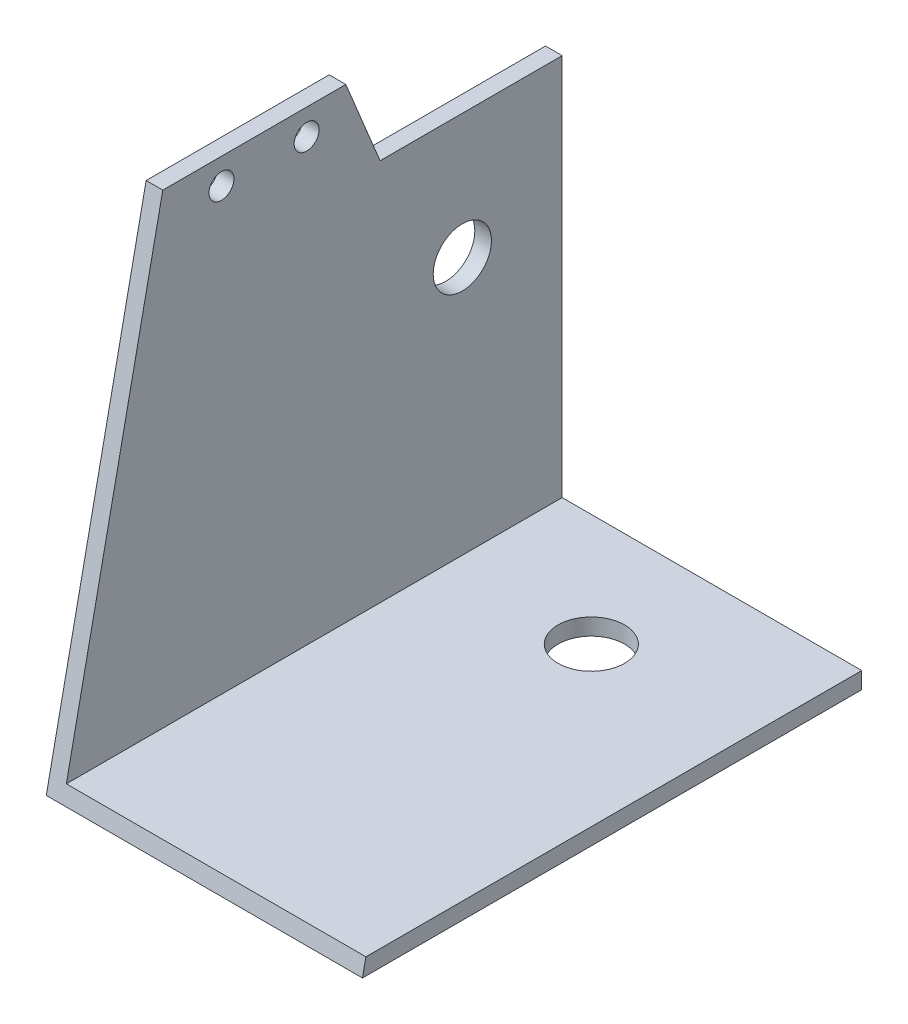
ISO-10303-21;
HEADER;
FILE_DESCRIPTION(('STEP AP214'),'2;1');
FILE_NAME('part.step','',(''),(''),'','','');
FILE_SCHEMA(('AUTOMOTIVE_DESIGN { 1 0 10303 214 1 1 1 1 }'));
ENDSEC;
DATA;
#1=APPLICATION_CONTEXT('core data for automotive mechanical design processes');
#2=APPLICATION_PROTOCOL_DEFINITION('international standard','automotive_design',2000,#1);
#3=PRODUCT_CONTEXT('',#1,'mechanical');
#4=PRODUCT('Part','Part','',(#3));
#5=PRODUCT_RELATED_PRODUCT_CATEGORY('part','',(#4));
#6=PRODUCT_DEFINITION_FORMATION('','',#4);
#7=PRODUCT_DEFINITION_CONTEXT('part definition',#1,'design');
#8=PRODUCT_DEFINITION('design','',#6,#7);
#9=PRODUCT_DEFINITION_SHAPE('','',#8);
#10=(LENGTH_UNIT() NAMED_UNIT(*) SI_UNIT(.MILLI.,.METRE.));
#11=(NAMED_UNIT(*) PLANE_ANGLE_UNIT() SI_UNIT($,.RADIAN.));
#12=(NAMED_UNIT(*) SI_UNIT($,.STERADIAN.) SOLID_ANGLE_UNIT());
#13=UNCERTAINTY_MEASURE_WITH_UNIT(LENGTH_MEASURE(1.E-05),#10,'distance_accuracy_value','');
#14=(GEOMETRIC_REPRESENTATION_CONTEXT(3) GLOBAL_UNCERTAINTY_ASSIGNED_CONTEXT((#13)) GLOBAL_UNIT_ASSIGNED_CONTEXT((#10,
#11,#12)) REPRESENTATION_CONTEXT('',''));
#15=CARTESIAN_POINT('',(0.,0.,0.));
#16=DIRECTION('',(0.,0.,1.));
#17=DIRECTION('',(1.,0.,0.));
#18=AXIS2_PLACEMENT_3D('',#15,#16,#17);
#19=CARTESIAN_POINT('',(2.,58.,60.));
#20=DIRECTION('',(0.,-1.,0.));
#21=DIRECTION('',(0.,0.,-1.));
#22=AXIS2_PLACEMENT_3D('',#19,#20,#21);
#23=PLANE('',#22);
#24=DIRECTION('',(0.,0.,-1.));
#25=VECTOR('',#24,1.);
#26=CARTESIAN_POINT('',(0.,58.,60.));
#27=LINE('',#26,#25);
#28=CARTESIAN_POINT('',(0.,58.,48.));
#29=VERTEX_POINT('',#28);
#30=CARTESIAN_POINT('',(0.,58.,26.));
#31=VERTEX_POINT('',#30);
#32=EDGE_CURVE('E133',#29,#31,#27,.T.);
#33=ORIENTED_EDGE('',*,*,#32,.F.);
#34=DIRECTION('',(-1.,0.,0.));
#35=VECTOR('',#34,1.);
#36=CARTESIAN_POINT('',(38.,58.,48.));
#37=LINE('',#36,#35);
#38=CARTESIAN_POINT('',(2.,58.,48.));
#39=VERTEX_POINT('',#38);
#40=EDGE_CURVE('E168',#39,#29,#37,.T.);
#41=ORIENTED_EDGE('',*,*,#40,.F.);
#42=DIRECTION('',(0.,0.,-1.));
#43=VECTOR('',#42,1.);
#44=CARTESIAN_POINT('',(2.,58.,60.));
#45=LINE('',#44,#43);
#46=CARTESIAN_POINT('',(2.,58.,26.));
#47=VERTEX_POINT('',#46);
#48=EDGE_CURVE('E121',#39,#47,#45,.T.);
#49=ORIENTED_EDGE('',*,*,#48,.T.);
#50=DIRECTION('',(-1.,0.,0.));
#51=VECTOR('',#50,1.);
#52=CARTESIAN_POINT('',(38.,58.,26.));
#53=LINE('',#52,#51);
#54=EDGE_CURVE('E179',#47,#31,#53,.T.);
#55=ORIENTED_EDGE('',*,*,#54,.T.);
#56=EDGE_LOOP('',(#33,#41,#49,#55));
#57=FACE_BOUND('',#56,.T.);
#58=ADVANCED_FACE('F39',(#57),#23,.F.);
#59=CARTESIAN_POINT('',(0.,58.,60.));
#60=DIRECTION('',(1.,0.,0.));
#61=DIRECTION('',(0.,1.,0.));
#62=AXIS2_PLACEMENT_3D('',#59,#60,#61);
#63=PLANE('',#62);
#64=CARTESIAN_POINT('',(0.,33.,12.));
#65=DIRECTION('',(-1.,0.,0.));
#66=DIRECTION('',(0.,-1.,0.));
#67=AXIS2_PLACEMENT_3D('',#64,#65,#66);
#68=CIRCLE('',#67,3.5);
#69=CARTESIAN_POINT('',(0.,29.5,12.));
#70=VERTEX_POINT('',#69);
#71=EDGE_CURVE('E190',#70,#70,#68,.T.);
#72=ORIENTED_EDGE('',*,*,#71,.F.);
#73=EDGE_LOOP('',(#72));
#74=FACE_BOUND('',#73,.T.);
#75=CARTESIAN_POINT('',(0.,54.9126669429679,40.9484063406696));
#76=DIRECTION('',(-1.,0.,0.));
#77=DIRECTION('',(0.,-1.,0.));
#78=AXIS2_PLACEMENT_3D('',#75,#76,#77);
#79=CIRCLE('',#78,1.5);
#80=CARTESIAN_POINT('',(0.,53.4126669429679,40.9484063406696));
#81=VERTEX_POINT('',#80);
#82=EDGE_CURVE('E174',#81,#81,#79,.T.);
#83=ORIENTED_EDGE('',*,*,#82,.F.);
#84=EDGE_LOOP('',(#83));
#85=FACE_BOUND('',#84,.T.);
#86=CARTESIAN_POINT('',(0.,54.9126669429679,30.7108512919076));
#87=DIRECTION('',(-1.,0.,0.));
#88=DIRECTION('',(0.,-1.,0.));
#89=AXIS2_PLACEMENT_3D('',#86,#87,#88);
#90=CIRCLE('',#89,1.5);
#91=CARTESIAN_POINT('',(0.,53.4126669429679,30.7108512919076));
#92=VERTEX_POINT('',#91);
#93=EDGE_CURVE('E169',#92,#92,#90,.T.);
#94=ORIENTED_EDGE('',*,*,#93,.F.);
#95=EDGE_LOOP('',(#94));
#96=FACE_BOUND('',#95,.T.);
#97=DIRECTION('',(0.,0.,-1.));
#98=VECTOR('',#97,1.);
#99=CARTESIAN_POINT('',(0.,0.,60.));
#100=LINE('',#99,#98);
#101=CARTESIAN_POINT('',(0.,0.,60.));
#102=VERTEX_POINT('',#101);
#103=CARTESIAN_POINT('',(0.,0.,0.));
#104=VERTEX_POINT('',#103);
#105=EDGE_CURVE('E129',#102,#104,#100,.T.);
#106=ORIENTED_EDGE('',*,*,#105,.F.);
#107=DIRECTION('',(0.,-0.979260419507103,0.202605604035952));
#108=VECTOR('',#107,1.);
#109=CARTESIAN_POINT('',(0.,58.,48.));
#110=LINE('',#109,#108);
#111=EDGE_CURVE('E65',#29,#102,#110,.T.);
#112=ORIENTED_EDGE('',*,*,#111,.F.);
#113=ORIENTED_EDGE('',*,*,#32,.T.);
#114=DIRECTION('',(0.,0.924751216689497,0.380572183995749));
#115=VECTOR('',#114,1.);
#116=CARTESIAN_POINT('',(0.,58.,26.));
#117=LINE('',#116,#115);
#118=CARTESIAN_POINT('',(0.,48.,21.8845992616462));
#119=VERTEX_POINT('',#118);
#120=EDGE_CURVE('E180',#119,#31,#117,.T.);
#121=ORIENTED_EDGE('',*,*,#120,.F.);
#122=DIRECTION('',(0.,0.,1.));
#123=VECTOR('',#122,1.);
#124=CARTESIAN_POINT('',(0.,48.,21.8845992616462));
#125=LINE('',#124,#123);
#126=CARTESIAN_POINT('',(0.,48.,0.));
#127=VERTEX_POINT('',#126);
#128=EDGE_CURVE('E173',#127,#119,#125,.T.);
#129=ORIENTED_EDGE('',*,*,#128,.F.);
#130=DIRECTION('',(0.,-1.,0.));
#131=VECTOR('',#130,1.);
#132=CARTESIAN_POINT('',(0.,58.,0.));
#133=LINE('',#132,#131);
#134=EDGE_CURVE('E149',#127,#104,#133,.T.);
#135=ORIENTED_EDGE('',*,*,#134,.T.);
#136=EDGE_LOOP('',(#106,#112,#113,#121,#129,#135));
#137=FACE_BOUND('',#136,.T.);
#138=ADVANCED_FACE('F226',(#74,#85,#96,#137),#63,.F.);
#139=CARTESIAN_POINT('',(0.,0.,60.));
#140=DIRECTION('',(0.,1.,0.));
#141=DIRECTION('',(0.,0.,1.));
#142=AXIS2_PLACEMENT_3D('',#139,#140,#141);
#143=PLANE('',#142);
#144=CARTESIAN_POINT('',(19.,0.,13.5));
#145=DIRECTION('',(0.,-1.,0.));
#146=DIRECTION('',(0.,0.,-1.));
#147=AXIS2_PLACEMENT_3D('',#144,#145,#146);
#148=CIRCLE('',#147,4.);
#149=CARTESIAN_POINT('',(19.,0.,9.5));
#150=VERTEX_POINT('',#149);
#151=EDGE_CURVE('E204',#150,#150,#148,.T.);
#152=ORIENTED_EDGE('',*,*,#151,.F.);
#153=EDGE_LOOP('',(#152));
#154=FACE_BOUND('',#153,.T.);
#155=DIRECTION('',(1.,0.,0.));
#156=VECTOR('',#155,1.);
#157=CARTESIAN_POINT('',(0.,0.,0.));
#158=LINE('',#157,#156);
#159=CARTESIAN_POINT('',(38.,0.,0.));
#160=VERTEX_POINT('',#159);
#161=EDGE_CURVE('E108',#104,#160,#158,.T.);
#162=ORIENTED_EDGE('',*,*,#161,.T.);
#163=DIRECTION('',(0.,0.,-1.));
#164=VECTOR('',#163,1.);
#165=CARTESIAN_POINT('',(38.,0.,60.));
#166=LINE('',#165,#164);
#167=CARTESIAN_POINT('',(38.,0.,60.));
#168=VERTEX_POINT('',#167);
#169=EDGE_CURVE('E97',#168,#160,#166,.T.);
#170=ORIENTED_EDGE('',*,*,#169,.F.);
#171=DIRECTION('',(1.,0.,0.));
#172=VECTOR('',#171,1.);
#173=CARTESIAN_POINT('',(0.,0.,60.));
#174=LINE('',#173,#172);
#175=EDGE_CURVE('E117',#102,#168,#174,.T.);
#176=ORIENTED_EDGE('',*,*,#175,.F.);
#177=ORIENTED_EDGE('',*,*,#105,.T.);
#178=EDGE_LOOP('',(#162,#170,#176,#177));
#179=FACE_BOUND('',#178,.T.);
#180=ADVANCED_FACE('F231',(#154,#179),#143,.F.);
#181=CARTESIAN_POINT('',(38.,0.,60.));
#182=DIRECTION('',(-1.,0.,0.));
#183=DIRECTION('',(0.,0.,1.));
#184=AXIS2_PLACEMENT_3D('',#181,#182,#183);
#185=PLANE('',#184);
#186=DIRECTION('',(0.,0.,-1.));
#187=VECTOR('',#186,1.);
#188=CARTESIAN_POINT('',(38.,2.,60.));
#189=LINE('',#188,#187);
#190=CARTESIAN_POINT('',(38.,2.,59.5862068965517));
#191=VERTEX_POINT('',#190);
#192=CARTESIAN_POINT('',(38.,2.,0.));
#193=VERTEX_POINT('',#192);
#194=EDGE_CURVE('E84',#191,#193,#189,.T.);
#195=ORIENTED_EDGE('',*,*,#194,.F.);
#196=DIRECTION('',(0.,-0.979260419507103,0.202605604035952));
#197=VECTOR('',#196,1.);
#198=CARTESIAN_POINT('',(38.,58.,48.));
#199=LINE('',#198,#197);
#200=EDGE_CURVE('E199',#191,#168,#199,.T.);
#201=ORIENTED_EDGE('',*,*,#200,.T.);
#202=ORIENTED_EDGE('',*,*,#169,.T.);
#203=DIRECTION('',(0.,1.,0.));
#204=VECTOR('',#203,1.);
#205=CARTESIAN_POINT('',(38.,0.,0.));
#206=LINE('',#205,#204);
#207=EDGE_CURVE('E102',#160,#193,#206,.T.);
#208=ORIENTED_EDGE('',*,*,#207,.T.);
#209=EDGE_LOOP('',(#195,#201,#202,#208));
#210=FACE_BOUND('',#209,.T.);
#211=ADVANCED_FACE('F103',(#210),#185,.F.);
#212=CARTESIAN_POINT('',(38.,2.,60.));
#213=DIRECTION('',(0.,-1.,0.));
#214=DIRECTION('',(1.,0.,0.));
#215=AXIS2_PLACEMENT_3D('',#212,#213,#214);
#216=PLANE('',#215);
#217=CARTESIAN_POINT('',(19.,2.,13.5));
#218=DIRECTION('',(0.,-1.,0.));
#219=DIRECTION('',(1.,0.,0.));
#220=AXIS2_PLACEMENT_3D('',#217,#218,#219);
#221=CIRCLE('',#220,4.);
#222=CARTESIAN_POINT('',(23.,2.,13.5));
#223=VERTEX_POINT('',#222);
#224=EDGE_CURVE('E42',#223,#223,#221,.T.);
#225=ORIENTED_EDGE('',*,*,#224,.T.);
#226=EDGE_LOOP('',(#225));
#227=FACE_BOUND('',#226,.T.);
#228=DIRECTION('',(0.,0.,-1.));
#229=VECTOR('',#228,1.);
#230=CARTESIAN_POINT('',(2.,2.,60.));
#231=LINE('',#230,#229);
#232=CARTESIAN_POINT('',(2.,2.,59.5862068965517));
#233=VERTEX_POINT('',#232);
#234=CARTESIAN_POINT('',(2.,2.,0.));
#235=VERTEX_POINT('',#234);
#236=EDGE_CURVE('E98',#233,#235,#231,.T.);
#237=ORIENTED_EDGE('',*,*,#236,.F.);
#238=DIRECTION('',(1.,0.,0.));
#239=VECTOR('',#238,1.);
#240=CARTESIAN_POINT('',(38.,2.,59.5862068965517));
#241=LINE('',#240,#239);
#242=EDGE_CURVE('E93',#233,#191,#241,.T.);
#243=ORIENTED_EDGE('',*,*,#242,.T.);
#244=ORIENTED_EDGE('',*,*,#194,.T.);
#245=DIRECTION('',(-1.,0.,0.));
#246=VECTOR('',#245,1.);
#247=CARTESIAN_POINT('',(38.,2.,0.));
#248=LINE('',#247,#246);
#249=EDGE_CURVE('E89',#193,#235,#248,.T.);
#250=ORIENTED_EDGE('',*,*,#249,.T.);
#251=EDGE_LOOP('',(#237,#243,#244,#250));
#252=FACE_BOUND('',#251,.T.);
#253=ADVANCED_FACE('F87',(#227,#252),#216,.F.);
#254=CARTESIAN_POINT('',(2.,2.,60.));
#255=DIRECTION('',(-1.,0.,0.));
#256=DIRECTION('',(0.,0.,1.));
#257=AXIS2_PLACEMENT_3D('',#254,#255,#256);
#258=PLANE('',#257);
#259=CARTESIAN_POINT('',(2.,33.,12.));
#260=DIRECTION('',(-1.,0.,0.));
#261=DIRECTION('',(0.,0.,1.));
#262=AXIS2_PLACEMENT_3D('',#259,#260,#261);
#263=CIRCLE('',#262,3.5);
#264=CARTESIAN_POINT('',(2.,33.,15.5));
#265=VERTEX_POINT('',#264);
#266=EDGE_CURVE('E146',#265,#265,#263,.T.);
#267=ORIENTED_EDGE('',*,*,#266,.T.);
#268=EDGE_LOOP('',(#267));
#269=FACE_BOUND('',#268,.T.);
#270=CARTESIAN_POINT('',(2.,54.9126669429679,40.9484063406696));
#271=DIRECTION('',(-1.,0.,0.));
#272=DIRECTION('',(0.,0.,1.));
#273=AXIS2_PLACEMENT_3D('',#270,#271,#272);
#274=CIRCLE('',#273,1.5);
#275=CARTESIAN_POINT('',(2.,54.9126669429679,42.4484063406696));
#276=VERTEX_POINT('',#275);
#277=EDGE_CURVE('E143',#276,#276,#274,.T.);
#278=ORIENTED_EDGE('',*,*,#277,.T.);
#279=EDGE_LOOP('',(#278));
#280=FACE_BOUND('',#279,.T.);
#281=CARTESIAN_POINT('',(2.,54.9126669429679,30.7108512919076));
#282=DIRECTION('',(-1.,0.,0.));
#283=DIRECTION('',(0.,0.,1.));
#284=AXIS2_PLACEMENT_3D('',#281,#282,#283);
#285=CIRCLE('',#284,1.5);
#286=CARTESIAN_POINT('',(2.,54.9126669429679,32.2108512919076));
#287=VERTEX_POINT('',#286);
#288=EDGE_CURVE('E139',#287,#287,#285,.T.);
#289=ORIENTED_EDGE('',*,*,#288,.T.);
#290=EDGE_LOOP('',(#289));
#291=FACE_BOUND('',#290,.T.);
#292=ORIENTED_EDGE('',*,*,#48,.F.);
#293=DIRECTION('',(0.,-0.979260419507103,0.202605604035952));
#294=VECTOR('',#293,1.);
#295=CARTESIAN_POINT('',(2.,1.91790193842645,59.6031927023945));
#296=LINE('',#295,#294);
#297=EDGE_CURVE('E162',#39,#233,#296,.T.);
#298=ORIENTED_EDGE('',*,*,#297,.T.);
#299=ORIENTED_EDGE('',*,*,#236,.T.);
#300=DIRECTION('',(0.,1.,0.));
#301=VECTOR('',#300,1.);
#302=CARTESIAN_POINT('',(2.,2.,0.));
#303=LINE('',#302,#301);
#304=CARTESIAN_POINT('',(2.,48.,0.));
#305=VERTEX_POINT('',#304);
#306=EDGE_CURVE('E113',#235,#305,#303,.T.);
#307=ORIENTED_EDGE('',*,*,#306,.T.);
#308=DIRECTION('',(0.,0.,1.));
#309=VECTOR('',#308,1.);
#310=CARTESIAN_POINT('',(2.,48.,60.));
#311=LINE('',#310,#309);
#312=CARTESIAN_POINT('',(2.,48.,21.8845992616462));
#313=VERTEX_POINT('',#312);
#314=EDGE_CURVE('E56',#305,#313,#311,.T.);
#315=ORIENTED_EDGE('',*,*,#314,.T.);
#316=DIRECTION('',(0.,0.924751216689497,0.38057218399575));
#317=VECTOR('',#316,1.);
#318=CARTESIAN_POINT('',(2.,22.0765465513529,11.2160593153221));
#319=LINE('',#318,#317);
#320=EDGE_CURVE('E11',#313,#47,#319,.T.);
#321=ORIENTED_EDGE('',*,*,#320,.T.);
#322=EDGE_LOOP('',(#292,#298,#299,#307,#315,#321));
#323=FACE_BOUND('',#322,.T.);
#324=ADVANCED_FACE('F259',(#269,#280,#291,#323),#258,.F.);
#325=CARTESIAN_POINT('',(0.,0.,0.));
#326=DIRECTION('',(0.,0.,1.));
#327=DIRECTION('',(1.,0.,0.));
#328=AXIS2_PLACEMENT_3D('',#325,#326,#327);
#329=PLANE('',#328);
#330=ORIENTED_EDGE('',*,*,#134,.F.);
#331=DIRECTION('',(1.,0.,0.));
#332=VECTOR('',#331,1.);
#333=CARTESIAN_POINT('',(0.,48.,0.));
#334=LINE('',#333,#332);
#335=EDGE_CURVE('E48',#127,#305,#334,.T.);
#336=ORIENTED_EDGE('',*,*,#335,.T.);
#337=ORIENTED_EDGE('',*,*,#306,.F.);
#338=ORIENTED_EDGE('',*,*,#249,.F.);
#339=ORIENTED_EDGE('',*,*,#207,.F.);
#340=ORIENTED_EDGE('',*,*,#161,.F.);
#341=EDGE_LOOP('',(#330,#336,#337,#338,#339,#340));
#342=FACE_BOUND('',#341,.T.);
#343=ADVANCED_FACE('F111',(#342),#329,.F.);
#344=CARTESIAN_POINT('',(38.,58.,26.));
#345=DIRECTION('',(0.,-0.38057218399575,0.924751216689497));
#346=DIRECTION('',(0.,-0.924751216689497,-0.38057218399575));
#347=AXIS2_PLACEMENT_3D('',#344,#345,#346);
#348=PLANE('',#347);
#349=DIRECTION('',(-1.,0.,0.));
#350=VECTOR('',#349,1.);
#351=CARTESIAN_POINT('',(38.,48.,21.8845992616462));
#352=LINE('',#351,#350);
#353=EDGE_CURVE('E175',#313,#119,#352,.T.);
#354=ORIENTED_EDGE('',*,*,#353,.T.);
#355=ORIENTED_EDGE('',*,*,#120,.T.);
#356=ORIENTED_EDGE('',*,*,#54,.F.);
#357=ORIENTED_EDGE('',*,*,#320,.F.);
#358=EDGE_LOOP('',(#354,#355,#356,#357));
#359=FACE_BOUND('',#358,.T.);
#360=ADVANCED_FACE('F260',(#359),#348,.F.);
#361=CARTESIAN_POINT('',(38.,48.,21.8845992616462));
#362=DIRECTION('',(0.,-1.,0.));
#363=DIRECTION('',(1.,0.,0.));
#364=AXIS2_PLACEMENT_3D('',#361,#362,#363);
#365=PLANE('',#364);
#366=ORIENTED_EDGE('',*,*,#335,.F.);
#367=ORIENTED_EDGE('',*,*,#128,.T.);
#368=ORIENTED_EDGE('',*,*,#353,.F.);
#369=ORIENTED_EDGE('',*,*,#314,.F.);
#370=EDGE_LOOP('',(#366,#367,#368,#369));
#371=FACE_BOUND('',#370,.T.);
#372=ADVANCED_FACE('F261',(#371),#365,.F.);
#373=CARTESIAN_POINT('',(38.,58.,48.));
#374=DIRECTION('',(0.,-0.202605604035952,-0.979260419507103));
#375=DIRECTION('',(0.,0.979260419507103,-0.202605604035952));
#376=AXIS2_PLACEMENT_3D('',#373,#374,#375);
#377=PLANE('',#376);
#378=ORIENTED_EDGE('',*,*,#297,.F.);
#379=ORIENTED_EDGE('',*,*,#40,.T.);
#380=ORIENTED_EDGE('',*,*,#111,.T.);
#381=ORIENTED_EDGE('',*,*,#175,.T.);
#382=ORIENTED_EDGE('',*,*,#200,.F.);
#383=ORIENTED_EDGE('',*,*,#242,.F.);
#384=EDGE_LOOP('',(#378,#379,#380,#381,#382,#383));
#385=FACE_BOUND('',#384,.T.);
#386=ADVANCED_FACE('F257',(#385),#377,.F.);
#387=CARTESIAN_POINT('',(38.,54.9126669429679,30.7108512919076));
#388=DIRECTION('',(-1.,0.,0.));
#389=DIRECTION('',(0.,-1.,0.));
#390=AXIS2_PLACEMENT_3D('',#387,#388,#389);
#391=CYLINDRICAL_SURFACE('',#390,1.5);
#392=ORIENTED_EDGE('',*,*,#93,.T.);
#393=EDGE_LOOP('',(#392));
#394=FACE_BOUND('',#393,.T.);
#395=ORIENTED_EDGE('',*,*,#288,.F.);
#396=EDGE_LOOP('',(#395));
#397=FACE_BOUND('',#396,.T.);
#398=ADVANCED_FACE('F279',(#394,#397),#391,.F.);
#399=CARTESIAN_POINT('',(38.,54.9126669429679,40.9484063406696));
#400=DIRECTION('',(-1.,0.,0.));
#401=DIRECTION('',(0.,-1.,0.));
#402=AXIS2_PLACEMENT_3D('',#399,#400,#401);
#403=CYLINDRICAL_SURFACE('',#402,1.5);
#404=ORIENTED_EDGE('',*,*,#82,.T.);
#405=EDGE_LOOP('',(#404));
#406=FACE_BOUND('',#405,.T.);
#407=ORIENTED_EDGE('',*,*,#277,.F.);
#408=EDGE_LOOP('',(#407));
#409=FACE_BOUND('',#408,.T.);
#410=ADVANCED_FACE('F221',(#406,#409),#403,.F.);
#411=CARTESIAN_POINT('',(38.,33.,12.));
#412=DIRECTION('',(-1.,0.,0.));
#413=DIRECTION('',(0.,-1.,0.));
#414=AXIS2_PLACEMENT_3D('',#411,#412,#413);
#415=CYLINDRICAL_SURFACE('',#414,3.5);
#416=ORIENTED_EDGE('',*,*,#71,.T.);
#417=EDGE_LOOP('',(#416));
#418=FACE_BOUND('',#417,.T.);
#419=ORIENTED_EDGE('',*,*,#266,.F.);
#420=EDGE_LOOP('',(#419));
#421=FACE_BOUND('',#420,.T.);
#422=ADVANCED_FACE('F216',(#418,#421),#415,.F.);
#423=CARTESIAN_POINT('',(19.,50.,13.5));
#424=DIRECTION('',(0.,-1.,0.));
#425=DIRECTION('',(0.,0.,-1.));
#426=AXIS2_PLACEMENT_3D('',#423,#424,#425);
#427=CYLINDRICAL_SURFACE('',#426,4.);
#428=ORIENTED_EDGE('',*,*,#151,.T.);
#429=EDGE_LOOP('',(#428));
#430=FACE_BOUND('',#429,.T.);
#431=ORIENTED_EDGE('',*,*,#224,.F.);
#432=EDGE_LOOP('',(#431));
#433=FACE_BOUND('',#432,.T.);
#434=ADVANCED_FACE('F214',(#430,#433),#427,.F.);
#435=CLOSED_SHELL('',(#58,#138,#180,#211,#253,#324,#343,#360,#372,#386,#398,#410,#422,#434));
#436=MANIFOLD_SOLID_BREP('B2',#435);
#437=ADVANCED_BREP_SHAPE_REPRESENTATION('',(#18,#436),#14);
#438=SHAPE_DEFINITION_REPRESENTATION(#9,#437);
ENDSEC;
END-ISO-10303-21;
